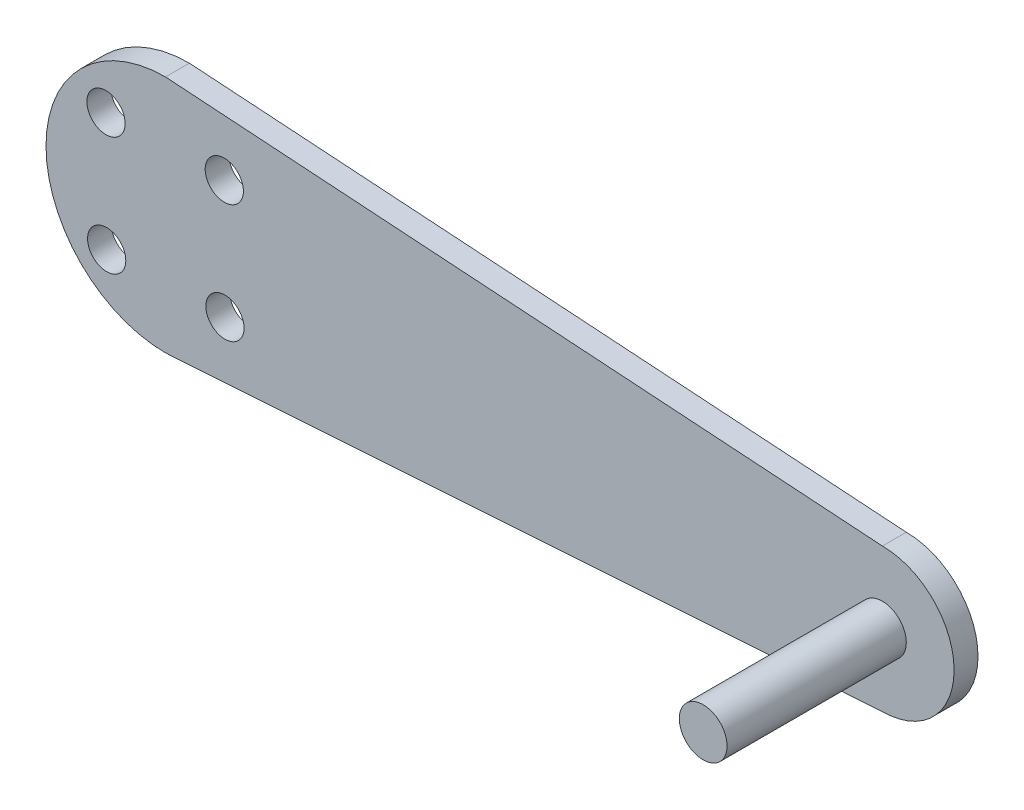
ISO-10303-21;
HEADER;
FILE_DESCRIPTION(('STEP AP214'),'2;1');
FILE_NAME('part.step','',(''),(''),'','','');
FILE_SCHEMA(('AUTOMOTIVE_DESIGN { 1 0 10303 214 1 1 1 1 }'));
ENDSEC;
DATA;
#1=APPLICATION_CONTEXT('core data for automotive mechanical design processes');
#2=APPLICATION_PROTOCOL_DEFINITION('international standard','automotive_design',2000,#1);
#3=PRODUCT_CONTEXT('',#1,'mechanical');
#4=PRODUCT('Part','Part','',(#3));
#5=PRODUCT_RELATED_PRODUCT_CATEGORY('part','',(#4));
#6=PRODUCT_DEFINITION_FORMATION('','',#4);
#7=PRODUCT_DEFINITION_CONTEXT('part definition',#1,'design');
#8=PRODUCT_DEFINITION('design','',#6,#7);
#9=PRODUCT_DEFINITION_SHAPE('','',#8);
#10=(LENGTH_UNIT() NAMED_UNIT(*) SI_UNIT(.MILLI.,.METRE.));
#11=(NAMED_UNIT(*) PLANE_ANGLE_UNIT() SI_UNIT($,.RADIAN.));
#12=(NAMED_UNIT(*) SI_UNIT($,.STERADIAN.) SOLID_ANGLE_UNIT());
#13=UNCERTAINTY_MEASURE_WITH_UNIT(LENGTH_MEASURE(1.E-05),#10,'distance_accuracy_value','');
#14=(GEOMETRIC_REPRESENTATION_CONTEXT(3) GLOBAL_UNCERTAINTY_ASSIGNED_CONTEXT((#13)) GLOBAL_UNIT_ASSIGNED_CONTEXT((#10,
#11,#12)) REPRESENTATION_CONTEXT('',''));
#15=CARTESIAN_POINT('',(0.,0.,0.));
#16=DIRECTION('',(0.,0.,1.));
#17=DIRECTION('',(1.,0.,0.));
#18=AXIS2_PLACEMENT_3D('',#15,#16,#17);
#19=CARTESIAN_POINT('',(0.663716814159292,-9.95575221238938,2.));
#20=DIRECTION('',(-0.0665190105237739,0.997785157856609,0.));
#21=DIRECTION('',(-0.997785157856609,-0.0665190105237739,0.));
#22=AXIS2_PLACEMENT_3D('',#19,#20,#21);
#23=PLANE('',#22);
#24=DIRECTION('',(0.997785157856609,0.0665190105237739,0.));
#25=VECTOR('',#24,1.);
#26=CARTESIAN_POINT('',(0.663716814159292,-9.95575221238938,0.));
#27=LINE('',#26,#25);
#28=CARTESIAN_POINT('',(0.,-10.,0.));
#29=VERTEX_POINT('',#28);
#30=CARTESIAN_POINT('',(60.,-6.,0.));
#31=VERTEX_POINT('',#30);
#32=EDGE_CURVE('E102',#29,#31,#27,.T.);
#33=ORIENTED_EDGE('',*,*,#32,.T.);
#34=DIRECTION('',(0.,0.,-1.));
#35=VECTOR('',#34,1.);
#36=CARTESIAN_POINT('',(60.,-6.,2.));
#37=LINE('',#36,#35);
#38=CARTESIAN_POINT('',(60.,-6.,2.));
#39=VERTEX_POINT('',#38);
#40=EDGE_CURVE('E11',#39,#31,#37,.T.);
#41=ORIENTED_EDGE('',*,*,#40,.F.);
#42=DIRECTION('',(0.997785157856609,0.0665190105237739,0.));
#43=VECTOR('',#42,1.);
#44=CARTESIAN_POINT('',(0.663716814159292,-9.95575221238938,2.));
#45=LINE('',#44,#43);
#46=CARTESIAN_POINT('',(0.,-10.,2.));
#47=VERTEX_POINT('',#46);
#48=EDGE_CURVE('E86',#47,#39,#45,.T.);
#49=ORIENTED_EDGE('',*,*,#48,.F.);
#50=DIRECTION('',(0.,0.,-1.));
#51=VECTOR('',#50,1.);
#52=CARTESIAN_POINT('',(0.,-10.,2.));
#53=LINE('',#52,#51);
#54=EDGE_CURVE('E98',#47,#29,#53,.T.);
#55=ORIENTED_EDGE('',*,*,#54,.T.);
#56=EDGE_LOOP('',(#33,#41,#49,#55));
#57=FACE_BOUND('',#56,.T.);
#58=ADVANCED_FACE('F37',(#57),#23,.F.);
#59=CARTESIAN_POINT('',(60.,0.,2.));
#60=DIRECTION('',(0.,0.,-1.));
#61=DIRECTION('',(-1.,0.,0.));
#62=AXIS2_PLACEMENT_3D('',#59,#60,#61);
#63=CYLINDRICAL_SURFACE('',#62,6.);
#64=CARTESIAN_POINT('',(60.,0.,0.));
#65=DIRECTION('',(0.,0.,1.));
#66=DIRECTION('',(1.,0.,0.));
#67=AXIS2_PLACEMENT_3D('',#64,#65,#66);
#68=CIRCLE('',#67,6.);
#69=CARTESIAN_POINT('',(60.,6.,0.));
#70=VERTEX_POINT('',#69);
#71=EDGE_CURVE('E91',#31,#70,#68,.T.);
#72=ORIENTED_EDGE('',*,*,#71,.T.);
#73=DIRECTION('',(0.,0.,-1.));
#74=VECTOR('',#73,1.);
#75=CARTESIAN_POINT('',(60.,6.,2.));
#76=LINE('',#75,#74);
#77=CARTESIAN_POINT('',(60.,6.,2.));
#78=VERTEX_POINT('',#77);
#79=EDGE_CURVE('E46',#78,#70,#76,.T.);
#80=ORIENTED_EDGE('',*,*,#79,.F.);
#81=CARTESIAN_POINT('',(60.,0.,2.));
#82=DIRECTION('',(0.,0.,1.));
#83=DIRECTION('',(1.,0.,0.));
#84=AXIS2_PLACEMENT_3D('',#81,#82,#83);
#85=CIRCLE('',#84,6.);
#86=EDGE_CURVE('E81',#39,#78,#85,.T.);
#87=ORIENTED_EDGE('',*,*,#86,.F.);
#88=ORIENTED_EDGE('',*,*,#40,.T.);
#89=EDGE_LOOP('',(#72,#80,#87,#88));
#90=FACE_BOUND('',#89,.T.);
#91=ADVANCED_FACE('F90',(#90),#63,.T.);
#92=CARTESIAN_POINT('',(0.663716814159292,9.95575221238938,2.));
#93=DIRECTION('',(0.0665190105237739,0.997785157856609,0.));
#94=DIRECTION('',(-0.997785157856609,0.0665190105237739,0.));
#95=AXIS2_PLACEMENT_3D('',#92,#93,#94);
#96=PLANE('',#95);
#97=DIRECTION('',(0.997785157856609,-0.0665190105237739,0.));
#98=VECTOR('',#97,1.);
#99=CARTESIAN_POINT('',(0.663716814159292,9.95575221238938,0.));
#100=LINE('',#99,#98);
#101=CARTESIAN_POINT('',(0.,10.,0.));
#102=VERTEX_POINT('',#101);
#103=EDGE_CURVE('E106',#102,#70,#100,.T.);
#104=ORIENTED_EDGE('',*,*,#103,.F.);
#105=DIRECTION('',(0.,0.,-1.));
#106=VECTOR('',#105,1.);
#107=CARTESIAN_POINT('',(0.,10.,2.));
#108=LINE('',#107,#106);
#109=CARTESIAN_POINT('',(0.,10.,2.));
#110=VERTEX_POINT('',#109);
#111=EDGE_CURVE('E71',#110,#102,#108,.T.);
#112=ORIENTED_EDGE('',*,*,#111,.F.);
#113=DIRECTION('',(0.997785157856609,-0.0665190105237739,0.));
#114=VECTOR('',#113,1.);
#115=CARTESIAN_POINT('',(0.663716814159292,9.95575221238938,2.));
#116=LINE('',#115,#114);
#117=EDGE_CURVE('E84',#110,#78,#116,.T.);
#118=ORIENTED_EDGE('',*,*,#117,.T.);
#119=ORIENTED_EDGE('',*,*,#79,.T.);
#120=EDGE_LOOP('',(#104,#112,#118,#119));
#121=FACE_BOUND('',#120,.T.);
#122=ADVANCED_FACE('F96',(#121),#96,.T.);
#123=CARTESIAN_POINT('',(0.,0.,2.));
#124=DIRECTION('',(0.,0.,-1.));
#125=DIRECTION('',(-1.,0.,0.));
#126=AXIS2_PLACEMENT_3D('',#123,#124,#125);
#127=CYLINDRICAL_SURFACE('',#126,10.);
#128=CARTESIAN_POINT('',(0.,0.,0.));
#129=DIRECTION('',(0.,0.,1.));
#130=DIRECTION('',(1.,0.,0.));
#131=AXIS2_PLACEMENT_3D('',#128,#129,#130);
#132=CIRCLE('',#131,10.);
#133=EDGE_CURVE('E74',#102,#29,#132,.T.);
#134=ORIENTED_EDGE('',*,*,#133,.T.);
#135=ORIENTED_EDGE('',*,*,#54,.F.);
#136=CARTESIAN_POINT('',(0.,0.,2.));
#137=DIRECTION('',(0.,0.,1.));
#138=DIRECTION('',(1.,0.,0.));
#139=AXIS2_PLACEMENT_3D('',#136,#137,#138);
#140=CIRCLE('',#139,10.);
#141=EDGE_CURVE('E55',#110,#47,#140,.T.);
#142=ORIENTED_EDGE('',*,*,#141,.F.);
#143=ORIENTED_EDGE('',*,*,#111,.T.);
#144=EDGE_LOOP('',(#134,#135,#142,#143));
#145=FACE_BOUND('',#144,.T.);
#146=ADVANCED_FACE('F159',(#145),#127,.T.);
#147=CARTESIAN_POINT('',(0.,0.,2.));
#148=DIRECTION('',(0.,0.,1.));
#149=DIRECTION('',(1.,0.,0.));
#150=AXIS2_PLACEMENT_3D('',#147,#148,#149);
#151=PLANE('',#150);
#152=CARTESIAN_POINT('',(60.,0.,2.));
#153=DIRECTION('',(0.,0.,1.));
#154=DIRECTION('',(1.,0.,0.));
#155=AXIS2_PLACEMENT_3D('',#152,#153,#154);
#156=CIRCLE('',#155,2.);
#157=CARTESIAN_POINT('',(62.,0.,2.));
#158=VERTEX_POINT('',#157);
#159=EDGE_CURVE('E226',#158,#158,#156,.T.);
#160=ORIENTED_EDGE('',*,*,#159,.F.);
#161=EDGE_LOOP('',(#160));
#162=FACE_BOUND('',#161,.T.);
#163=CARTESIAN_POINT('',(-4.92192680707055,-4.97741263166292,2.));
#164=DIRECTION('',(0.,0.,1.));
#165=DIRECTION('',(1.,0.,0.));
#166=AXIS2_PLACEMENT_3D('',#163,#164,#165);
#167=CIRCLE('',#166,1.60000000000014);
#168=CARTESIAN_POINT('',(-3.32192680707041,-4.97741263166292,2.));
#169=VERTEX_POINT('',#168);
#170=EDGE_CURVE('E223',#169,#169,#167,.T.);
#171=ORIENTED_EDGE('',*,*,#170,.F.);
#172=EDGE_LOOP('',(#171));
#173=FACE_BOUND('',#172,.T.);
#174=CARTESIAN_POINT('',(4.97741263166319,-4.92192680707055,2.));
#175=DIRECTION('',(0.,0.,1.));
#176=DIRECTION('',(1.,0.,0.));
#177=AXIS2_PLACEMENT_3D('',#174,#175,#176);
#178=CIRCLE('',#177,1.60000000000039);
#179=CARTESIAN_POINT('',(6.57741263166358,-4.92192680707055,2.));
#180=VERTEX_POINT('',#179);
#181=EDGE_CURVE('E218',#180,#180,#178,.T.);
#182=ORIENTED_EDGE('',*,*,#181,.F.);
#183=EDGE_LOOP('',(#182));
#184=FACE_BOUND('',#183,.T.);
#185=CARTESIAN_POINT('',(4.92192680707083,4.9774126316632,2.));
#186=DIRECTION('',(0.,0.,1.));
#187=DIRECTION('',(1.,0.,0.));
#188=AXIS2_PLACEMENT_3D('',#185,#186,#187);
#189=CIRCLE('',#188,1.60000000000029);
#190=CARTESIAN_POINT('',(6.52192680707111,4.9774126316632,2.));
#191=VERTEX_POINT('',#190);
#192=EDGE_CURVE('E211',#191,#191,#189,.T.);
#193=ORIENTED_EDGE('',*,*,#192,.F.);
#194=EDGE_LOOP('',(#193));
#195=FACE_BOUND('',#194,.T.);
#196=CARTESIAN_POINT('',(-4.97741263166292,4.92192680707083,2.));
#197=DIRECTION('',(0.,0.,1.));
#198=DIRECTION('',(1.,0.,0.));
#199=AXIS2_PLACEMENT_3D('',#196,#197,#198);
#200=CIRCLE('',#199,1.6);
#201=CARTESIAN_POINT('',(-3.37741263166292,4.92192680707083,2.));
#202=VERTEX_POINT('',#201);
#203=EDGE_CURVE('E115',#202,#202,#200,.T.);
#204=ORIENTED_EDGE('',*,*,#203,.F.);
#205=EDGE_LOOP('',(#204));
#206=FACE_BOUND('',#205,.T.);
#207=ORIENTED_EDGE('',*,*,#48,.T.);
#208=ORIENTED_EDGE('',*,*,#86,.T.);
#209=ORIENTED_EDGE('',*,*,#117,.F.);
#210=ORIENTED_EDGE('',*,*,#141,.T.);
#211=EDGE_LOOP('',(#207,#208,#209,#210));
#212=FACE_BOUND('',#211,.T.);
#213=ADVANCED_FACE('F82',(#162,#173,#184,#195,#206,#212),#151,.T.);
#214=CARTESIAN_POINT('',(0.,0.,0.));
#215=DIRECTION('',(0.,0.,1.));
#216=DIRECTION('',(1.,0.,0.));
#217=AXIS2_PLACEMENT_3D('',#214,#215,#216);
#218=PLANE('',#217);
#219=CARTESIAN_POINT('',(-4.92192680707055,-4.97741263166292,0.));
#220=DIRECTION('',(0.,0.,1.));
#221=DIRECTION('',(1.,0.,0.));
#222=AXIS2_PLACEMENT_3D('',#219,#220,#221);
#223=CIRCLE('',#222,1.60000000000014);
#224=CARTESIAN_POINT('',(-3.32192680707041,-4.97741263166292,0.));
#225=VERTEX_POINT('',#224);
#226=EDGE_CURVE('E40',#225,#225,#223,.T.);
#227=ORIENTED_EDGE('',*,*,#226,.T.);
#228=EDGE_LOOP('',(#227));
#229=FACE_BOUND('',#228,.T.);
#230=CARTESIAN_POINT('',(4.97741263166319,-4.92192680707055,0.));
#231=DIRECTION('',(0.,0.,1.));
#232=DIRECTION('',(1.,0.,0.));
#233=AXIS2_PLACEMENT_3D('',#230,#231,#232);
#234=CIRCLE('',#233,1.60000000000039);
#235=CARTESIAN_POINT('',(6.57741263166358,-4.92192680707055,0.));
#236=VERTEX_POINT('',#235);
#237=EDGE_CURVE('E117',#236,#236,#234,.T.);
#238=ORIENTED_EDGE('',*,*,#237,.T.);
#239=EDGE_LOOP('',(#238));
#240=FACE_BOUND('',#239,.T.);
#241=CARTESIAN_POINT('',(4.92192680707083,4.9774126316632,0.));
#242=DIRECTION('',(0.,0.,1.));
#243=DIRECTION('',(1.,0.,0.));
#244=AXIS2_PLACEMENT_3D('',#241,#242,#243);
#245=CIRCLE('',#244,1.60000000000029);
#246=CARTESIAN_POINT('',(6.52192680707111,4.9774126316632,0.));
#247=VERTEX_POINT('',#246);
#248=EDGE_CURVE('E114',#247,#247,#245,.T.);
#249=ORIENTED_EDGE('',*,*,#248,.T.);
#250=EDGE_LOOP('',(#249));
#251=FACE_BOUND('',#250,.T.);
#252=CARTESIAN_POINT('',(-4.97741263166292,4.92192680707083,0.));
#253=DIRECTION('',(0.,0.,1.));
#254=DIRECTION('',(1.,0.,0.));
#255=AXIS2_PLACEMENT_3D('',#252,#253,#254);
#256=CIRCLE('',#255,1.6);
#257=CARTESIAN_POINT('',(-3.37741263166292,4.92192680707083,0.));
#258=VERTEX_POINT('',#257);
#259=EDGE_CURVE('E111',#258,#258,#256,.T.);
#260=ORIENTED_EDGE('',*,*,#259,.T.);
#261=EDGE_LOOP('',(#260));
#262=FACE_BOUND('',#261,.T.);
#263=ORIENTED_EDGE('',*,*,#32,.F.);
#264=ORIENTED_EDGE('',*,*,#133,.F.);
#265=ORIENTED_EDGE('',*,*,#103,.T.);
#266=ORIENTED_EDGE('',*,*,#71,.F.);
#267=EDGE_LOOP('',(#263,#264,#265,#266));
#268=FACE_BOUND('',#267,.T.);
#269=ADVANCED_FACE('F124',(#229,#240,#251,#262,#268),#218,.F.);
#270=CARTESIAN_POINT('',(-4.97741263166292,4.92192680707083,-8.));
#271=DIRECTION('',(0.,0.,1.));
#272=DIRECTION('',(1.,0.,0.));
#273=AXIS2_PLACEMENT_3D('',#270,#271,#272);
#274=CYLINDRICAL_SURFACE('',#273,1.6);
#275=ORIENTED_EDGE('',*,*,#203,.T.);
#276=EDGE_LOOP('',(#275));
#277=FACE_BOUND('',#276,.T.);
#278=ORIENTED_EDGE('',*,*,#259,.F.);
#279=EDGE_LOOP('',(#278));
#280=FACE_BOUND('',#279,.T.);
#281=ADVANCED_FACE('F152',(#277,#280),#274,.F.);
#282=CARTESIAN_POINT('',(4.92192680707083,4.9774126316632,-8.));
#283=DIRECTION('',(0.,0.,1.));
#284=DIRECTION('',(1.,0.,0.));
#285=AXIS2_PLACEMENT_3D('',#282,#283,#284);
#286=CYLINDRICAL_SURFACE('',#285,1.60000000000029);
#287=ORIENTED_EDGE('',*,*,#192,.T.);
#288=EDGE_LOOP('',(#287));
#289=FACE_BOUND('',#288,.T.);
#290=ORIENTED_EDGE('',*,*,#248,.F.);
#291=EDGE_LOOP('',(#290));
#292=FACE_BOUND('',#291,.T.);
#293=ADVANCED_FACE('F139',(#289,#292),#286,.F.);
#294=CARTESIAN_POINT('',(4.97741263166319,-4.92192680707055,-8.));
#295=DIRECTION('',(0.,0.,1.));
#296=DIRECTION('',(1.,0.,0.));
#297=AXIS2_PLACEMENT_3D('',#294,#295,#296);
#298=CYLINDRICAL_SURFACE('',#297,1.60000000000039);
#299=ORIENTED_EDGE('',*,*,#181,.T.);
#300=EDGE_LOOP('',(#299));
#301=FACE_BOUND('',#300,.T.);
#302=ORIENTED_EDGE('',*,*,#237,.F.);
#303=EDGE_LOOP('',(#302));
#304=FACE_BOUND('',#303,.T.);
#305=ADVANCED_FACE('F129',(#301,#304),#298,.F.);
#306=CARTESIAN_POINT('',(-4.92192680707055,-4.97741263166292,-8.));
#307=DIRECTION('',(0.,0.,1.));
#308=DIRECTION('',(1.,0.,0.));
#309=AXIS2_PLACEMENT_3D('',#306,#307,#308);
#310=CYLINDRICAL_SURFACE('',#309,1.60000000000014);
#311=ORIENTED_EDGE('',*,*,#170,.T.);
#312=EDGE_LOOP('',(#311));
#313=FACE_BOUND('',#312,.T.);
#314=ORIENTED_EDGE('',*,*,#226,.F.);
#315=EDGE_LOOP('',(#314));
#316=FACE_BOUND('',#315,.T.);
#317=ADVANCED_FACE('F126',(#313,#316),#310,.F.);
#318=CARTESIAN_POINT('',(60.,0.,17.));
#319=DIRECTION('',(0.,0.,-1.));
#320=DIRECTION('',(-1.,0.,0.));
#321=AXIS2_PLACEMENT_3D('',#318,#319,#320);
#322=CYLINDRICAL_SURFACE('',#321,2.);
#323=CARTESIAN_POINT('',(60.,0.,17.));
#324=DIRECTION('',(0.,0.,1.));
#325=DIRECTION('',(1.,0.,0.));
#326=AXIS2_PLACEMENT_3D('',#323,#324,#325);
#327=CIRCLE('',#326,2.);
#328=CARTESIAN_POINT('',(62.,0.,17.));
#329=VERTEX_POINT('',#328);
#330=EDGE_CURVE('E229',#329,#329,#327,.T.);
#331=ORIENTED_EDGE('',*,*,#330,.F.);
#332=EDGE_LOOP('',(#331));
#333=FACE_BOUND('',#332,.T.);
#334=ORIENTED_EDGE('',*,*,#159,.T.);
#335=EDGE_LOOP('',(#334));
#336=FACE_BOUND('',#335,.T.);
#337=ADVANCED_FACE('F128',(#333,#336),#322,.T.);
#338=CARTESIAN_POINT('',(60.,0.,17.));
#339=DIRECTION('',(0.,0.,1.));
#340=DIRECTION('',(1.,0.,0.));
#341=AXIS2_PLACEMENT_3D('',#338,#339,#340);
#342=PLANE('',#341);
#343=ORIENTED_EDGE('',*,*,#330,.T.);
#344=EDGE_LOOP('',(#343));
#345=FACE_BOUND('',#344,.T.);
#346=ADVANCED_FACE('F136',(#345),#342,.T.);
#347=CLOSED_SHELL('',(#58,#91,#122,#146,#213,#269,#281,#293,#305,#317,#337,#346));
#348=MANIFOLD_SOLID_BREP('B2',#347);
#349=ADVANCED_BREP_SHAPE_REPRESENTATION('',(#18,#348),#14);
#350=SHAPE_DEFINITION_REPRESENTATION(#9,#349);
ENDSEC;
END-ISO-10303-21;
